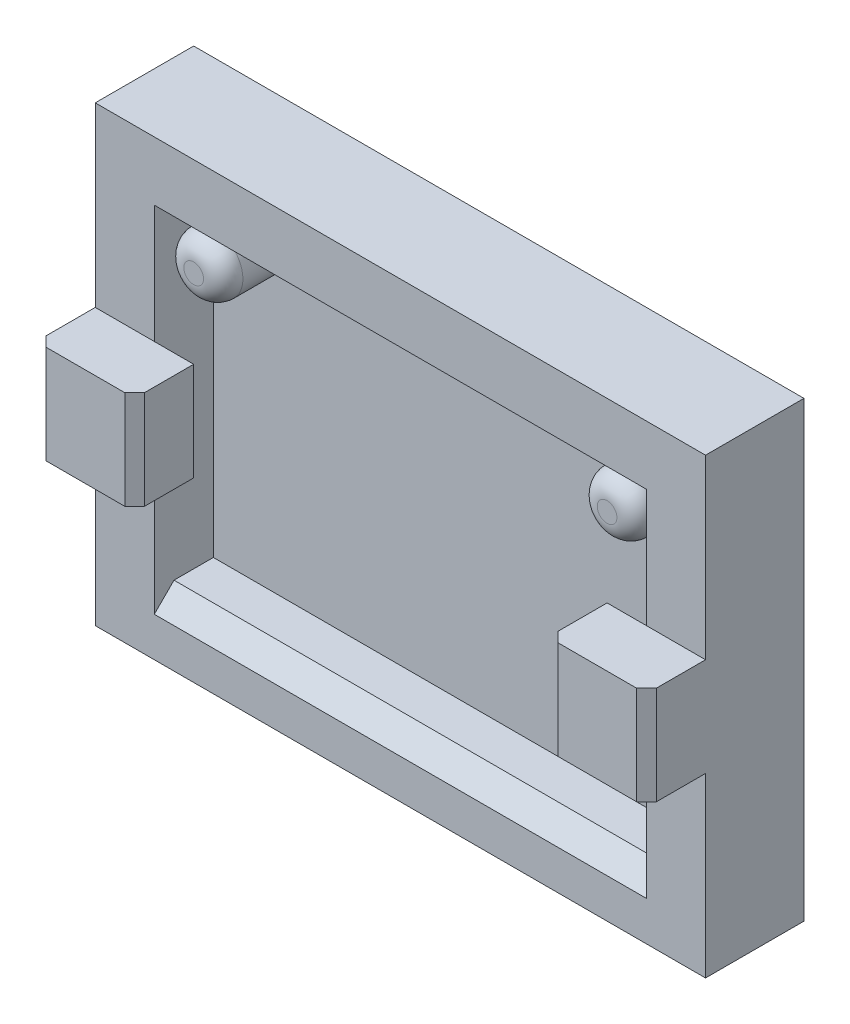
ISO-10303-21;
HEADER;
FILE_DESCRIPTION(('STEP AP214'),'2;1');
FILE_NAME('part.step','',(''),(''),'','','');
FILE_SCHEMA(('AUTOMOTIVE_DESIGN { 1 0 10303 214 1 1 1 1 }'));
ENDSEC;
DATA;
#1=APPLICATION_CONTEXT('core data for automotive mechanical design processes');
#2=APPLICATION_PROTOCOL_DEFINITION('international standard','automotive_design',2000,#1);
#3=PRODUCT_CONTEXT('',#1,'mechanical');
#4=PRODUCT('Part','Part','',(#3));
#5=PRODUCT_RELATED_PRODUCT_CATEGORY('part','',(#4));
#6=PRODUCT_DEFINITION_FORMATION('','',#4);
#7=PRODUCT_DEFINITION_CONTEXT('part definition',#1,'design');
#8=PRODUCT_DEFINITION('design','',#6,#7);
#9=PRODUCT_DEFINITION_SHAPE('','',#8);
#10=(LENGTH_UNIT() NAMED_UNIT(*) SI_UNIT(.MILLI.,.METRE.));
#11=(NAMED_UNIT(*) PLANE_ANGLE_UNIT() SI_UNIT($,.RADIAN.));
#12=(NAMED_UNIT(*) SI_UNIT($,.STERADIAN.) SOLID_ANGLE_UNIT());
#13=UNCERTAINTY_MEASURE_WITH_UNIT(LENGTH_MEASURE(1.E-05),#10,'distance_accuracy_value','');
#14=(GEOMETRIC_REPRESENTATION_CONTEXT(3) GLOBAL_UNCERTAINTY_ASSIGNED_CONTEXT((#13)) GLOBAL_UNIT_ASSIGNED_CONTEXT((#10,
#11,#12)) REPRESENTATION_CONTEXT('',''));
#15=CARTESIAN_POINT('',(0.,0.,0.));
#16=DIRECTION('',(0.,0.,1.));
#17=DIRECTION('',(1.,0.,0.));
#18=AXIS2_PLACEMENT_3D('',#15,#16,#17);
#19=CARTESIAN_POINT('',(0.,0.,5.));
#20=DIRECTION('',(0.,0.,1.));
#21=DIRECTION('',(1.,0.,0.));
#22=AXIS2_PLACEMENT_3D('',#19,#20,#21);
#23=PLANE('',#22);
#24=DIRECTION('',(0.,1.,0.));
#25=VECTOR('',#24,1.);
#26=CARTESIAN_POINT('',(-3.,20.,5.));
#27=LINE('',#26,#25);
#28=CARTESIAN_POINT('',(-3.,2.,5.));
#29=VERTEX_POINT('',#28);
#30=CARTESIAN_POINT('',(-3.,9.,5.));
#31=VERTEX_POINT('',#30);
#32=EDGE_CURVE('E48',#29,#31,#27,.T.);
#33=ORIENTED_EDGE('',*,*,#32,.F.);
#34=DIRECTION('',(-1.,0.,0.));
#35=VECTOR('',#34,1.);
#36=CARTESIAN_POINT('',(-28.,2.,5.));
#37=LINE('',#36,#35);
#38=CARTESIAN_POINT('',(-28.,2.,5.));
#39=VERTEX_POINT('',#38);
#40=EDGE_CURVE('E269',#29,#39,#37,.T.);
#41=ORIENTED_EDGE('',*,*,#40,.T.);
#42=DIRECTION('',(0.,-1.,0.));
#43=VECTOR('',#42,1.);
#44=CARTESIAN_POINT('',(-28.,20.,5.));
#45=LINE('',#44,#43);
#46=CARTESIAN_POINT('',(-28.,9.,5.));
#47=VERTEX_POINT('',#46);
#48=EDGE_CURVE('E55',#47,#39,#45,.T.);
#49=ORIENTED_EDGE('',*,*,#48,.F.);
#50=DIRECTION('',(1.,0.,0.));
#51=VECTOR('',#50,1.);
#52=CARTESIAN_POINT('',(-31.,9.,5.));
#53=LINE('',#52,#51);
#54=CARTESIAN_POINT('',(-31.,9.,5.));
#55=VERTEX_POINT('',#54);
#56=EDGE_CURVE('E239',#55,#47,#53,.T.);
#57=ORIENTED_EDGE('',*,*,#56,.F.);
#58=DIRECTION('',(0.,-1.,0.));
#59=VECTOR('',#58,1.);
#60=CARTESIAN_POINT('',(-31.,23.,5.));
#61=LINE('',#60,#59);
#62=CARTESIAN_POINT('',(-31.,0.,5.));
#63=VERTEX_POINT('',#62);
#64=EDGE_CURVE('E303',#55,#63,#61,.T.);
#65=ORIENTED_EDGE('',*,*,#64,.T.);
#66=DIRECTION('',(1.,0.,0.));
#67=VECTOR('',#66,1.);
#68=CARTESIAN_POINT('',(-31.,0.,5.));
#69=LINE('',#68,#67);
#70=CARTESIAN_POINT('',(0.,0.,5.));
#71=VERTEX_POINT('',#70);
#72=EDGE_CURVE('E356',#63,#71,#69,.T.);
#73=ORIENTED_EDGE('',*,*,#72,.T.);
#74=DIRECTION('',(0.,1.,0.));
#75=VECTOR('',#74,1.);
#76=CARTESIAN_POINT('',(0.,23.,5.));
#77=LINE('',#76,#75);
#78=CARTESIAN_POINT('',(0.,9.,5.));
#79=VERTEX_POINT('',#78);
#80=EDGE_CURVE('E365',#71,#79,#77,.T.);
#81=ORIENTED_EDGE('',*,*,#80,.T.);
#82=DIRECTION('',(1.,0.,0.));
#83=VECTOR('',#82,1.);
#84=CARTESIAN_POINT('',(-5.,9.,5.));
#85=LINE('',#84,#83);
#86=EDGE_CURVE('E210',#31,#79,#85,.T.);
#87=ORIENTED_EDGE('',*,*,#86,.F.);
#88=EDGE_LOOP('',(#33,#41,#49,#57,#65,#73,#81,#87));
#89=FACE_BOUND('',#88,.T.);
#90=ADVANCED_FACE('F33',(#89),#23,.T.);
#91=CARTESIAN_POINT('',(-3.,14.,5.));
#92=VERTEX_POINT('',#91);
#93=CARTESIAN_POINT('',(-3.,20.,5.));
#94=VERTEX_POINT('',#93);
#95=EDGE_CURVE('E695',#92,#94,#27,.T.);
#96=ORIENTED_EDGE('',*,*,#95,.F.);
#97=DIRECTION('',(-1.,0.,0.));
#98=VECTOR('',#97,1.);
#99=CARTESIAN_POINT('',(-5.,14.,5.));
#100=LINE('',#99,#98);
#101=CARTESIAN_POINT('',(0.,14.,5.));
#102=VERTEX_POINT('',#101);
#103=EDGE_CURVE('E221',#102,#92,#100,.T.);
#104=ORIENTED_EDGE('',*,*,#103,.F.);
#105=CARTESIAN_POINT('',(0.,23.,5.));
#106=VERTEX_POINT('',#105);
#107=EDGE_CURVE('E364',#102,#106,#77,.T.);
#108=ORIENTED_EDGE('',*,*,#107,.T.);
#109=DIRECTION('',(-1.,0.,0.));
#110=VECTOR('',#109,1.);
#111=CARTESIAN_POINT('',(-31.,23.,5.));
#112=LINE('',#111,#110);
#113=CARTESIAN_POINT('',(-31.,23.,5.));
#114=VERTEX_POINT('',#113);
#115=EDGE_CURVE('E368',#106,#114,#112,.T.);
#116=ORIENTED_EDGE('',*,*,#115,.T.);
#117=CARTESIAN_POINT('',(-31.,14.,5.));
#118=VERTEX_POINT('',#117);
#119=EDGE_CURVE('E353',#114,#118,#61,.T.);
#120=ORIENTED_EDGE('',*,*,#119,.T.);
#121=DIRECTION('',(-1.,0.,0.));
#122=VECTOR('',#121,1.);
#123=CARTESIAN_POINT('',(-31.,14.,5.));
#124=LINE('',#123,#122);
#125=CARTESIAN_POINT('',(-28.,14.,5.));
#126=VERTEX_POINT('',#125);
#127=EDGE_CURVE('E246',#126,#118,#124,.T.);
#128=ORIENTED_EDGE('',*,*,#127,.F.);
#129=CARTESIAN_POINT('',(-28.,20.,5.));
#130=VERTEX_POINT('',#129);
#131=EDGE_CURVE('E285',#130,#126,#45,.T.);
#132=ORIENTED_EDGE('',*,*,#131,.F.);
#133=DIRECTION('',(-1.,0.,0.));
#134=VECTOR('',#133,1.);
#135=CARTESIAN_POINT('',(-28.,20.,5.));
#136=LINE('',#135,#134);
#137=EDGE_CURVE('E699',#94,#130,#136,.T.);
#138=ORIENTED_EDGE('',*,*,#137,.F.);
#139=EDGE_LOOP('',(#96,#104,#108,#116,#120,#128,#132,#138));
#140=FACE_BOUND('',#139,.T.);
#141=ADVANCED_FACE('F417',(#140),#23,.T.);
#142=CARTESIAN_POINT('',(0.,0.,2.));
#143=DIRECTION('',(0.,0.,1.));
#144=DIRECTION('',(1.,0.,0.));
#145=AXIS2_PLACEMENT_3D('',#142,#143,#144);
#146=PLANE('',#145);
#147=CARTESIAN_POINT('',(-26.,18.,2.));
#148=DIRECTION('',(0.,0.,1.));
#149=DIRECTION('',(1.,0.,0.));
#150=AXIS2_PLACEMENT_3D('',#147,#148,#149);
#151=CIRCLE('',#150,1.5);
#152=CARTESIAN_POINT('',(-24.5,18.,2.));
#153=VERTEX_POINT('',#152);
#154=EDGE_CURVE('E283',#153,#153,#151,.T.);
#155=ORIENTED_EDGE('',*,*,#154,.F.);
#156=EDGE_LOOP('',(#155));
#157=FACE_BOUND('',#156,.T.);
#158=DIRECTION('',(0.,-1.,0.));
#159=VECTOR('',#158,1.);
#160=CARTESIAN_POINT('',(-28.,20.,2.));
#161=LINE('',#160,#159);
#162=CARTESIAN_POINT('',(-28.,20.,2.));
#163=VERTEX_POINT('',#162);
#164=CARTESIAN_POINT('',(-28.,3.,2.));
#165=VERTEX_POINT('',#164);
#166=EDGE_CURVE('E705',#163,#165,#161,.T.);
#167=ORIENTED_EDGE('',*,*,#166,.T.);
#168=DIRECTION('',(1.,0.,0.));
#169=VECTOR('',#168,1.);
#170=CARTESIAN_POINT('',(-28.,3.,2.));
#171=LINE('',#170,#169);
#172=CARTESIAN_POINT('',(-3.,3.,2.));
#173=VERTEX_POINT('',#172);
#174=EDGE_CURVE('E717',#165,#173,#171,.T.);
#175=ORIENTED_EDGE('',*,*,#174,.T.);
#176=DIRECTION('',(0.,1.,0.));
#177=VECTOR('',#176,1.);
#178=CARTESIAN_POINT('',(-3.,20.,2.));
#179=LINE('',#178,#177);
#180=CARTESIAN_POINT('',(-3.,20.,2.));
#181=VERTEX_POINT('',#180);
#182=EDGE_CURVE('E712',#173,#181,#179,.T.);
#183=ORIENTED_EDGE('',*,*,#182,.T.);
#184=DIRECTION('',(-1.,0.,0.));
#185=VECTOR('',#184,1.);
#186=CARTESIAN_POINT('',(-28.,20.,2.));
#187=LINE('',#186,#185);
#188=EDGE_CURVE('E709',#181,#163,#187,.T.);
#189=ORIENTED_EDGE('',*,*,#188,.T.);
#190=EDGE_LOOP('',(#167,#175,#183,#189));
#191=FACE_BOUND('',#190,.T.);
#192=CARTESIAN_POINT('',(-5.,18.,2.));
#193=DIRECTION('',(0.,0.,1.));
#194=DIRECTION('',(1.,0.,0.));
#195=AXIS2_PLACEMENT_3D('',#192,#193,#194);
#196=CIRCLE('',#195,1.5);
#197=CARTESIAN_POINT('',(-3.5,18.,2.));
#198=VERTEX_POINT('',#197);
#199=EDGE_CURVE('E256',#198,#198,#196,.T.);
#200=ORIENTED_EDGE('',*,*,#199,.F.);
#201=EDGE_LOOP('',(#200));
#202=FACE_BOUND('',#201,.T.);
#203=ADVANCED_FACE('F424',(#157,#191,#202),#146,.T.);
#204=CARTESIAN_POINT('',(-31.,23.,5.));
#205=DIRECTION('',(1.,0.,0.));
#206=DIRECTION('',(0.,1.,0.));
#207=AXIS2_PLACEMENT_3D('',#204,#205,#206);
#208=PLANE('',#207);
#209=DIRECTION('',(0.,0.,-1.));
#210=VECTOR('',#209,1.);
#211=CARTESIAN_POINT('',(-31.,9.,8.));
#212=LINE('',#211,#210);
#213=CARTESIAN_POINT('',(-31.,9.,7.49999999999999));
#214=VERTEX_POINT('',#213);
#215=EDGE_CURVE('E253',#214,#55,#212,.T.);
#216=ORIENTED_EDGE('',*,*,#215,.F.);
#217=DIRECTION('',(0.,1.,0.));
#218=VECTOR('',#217,1.);
#219=CARTESIAN_POINT('',(-31.,14.,7.49999999999999));
#220=LINE('',#219,#218);
#221=CARTESIAN_POINT('',(-31.,14.,7.49999999999999));
#222=VERTEX_POINT('',#221);
#223=EDGE_CURVE('E264',#214,#222,#220,.T.);
#224=ORIENTED_EDGE('',*,*,#223,.T.);
#225=DIRECTION('',(0.,0.,-1.));
#226=VECTOR('',#225,1.);
#227=CARTESIAN_POINT('',(-31.,14.,8.));
#228=LINE('',#227,#226);
#229=EDGE_CURVE('E235',#222,#118,#228,.T.);
#230=ORIENTED_EDGE('',*,*,#229,.T.);
#231=ORIENTED_EDGE('',*,*,#119,.F.);
#232=DIRECTION('',(0.,0.,-1.));
#233=VECTOR('',#232,1.);
#234=CARTESIAN_POINT('',(-31.,23.,5.));
#235=LINE('',#234,#233);
#236=CARTESIAN_POINT('',(-31.,23.,0.));
#237=VERTEX_POINT('',#236);
#238=EDGE_CURVE('E370',#114,#237,#235,.T.);
#239=ORIENTED_EDGE('',*,*,#238,.T.);
#240=DIRECTION('',(0.,-1.,0.));
#241=VECTOR('',#240,1.);
#242=CARTESIAN_POINT('',(-31.,23.,0.));
#243=LINE('',#242,#241);
#244=CARTESIAN_POINT('',(-31.,0.,0.));
#245=VERTEX_POINT('',#244);
#246=EDGE_CURVE('E371',#237,#245,#243,.T.);
#247=ORIENTED_EDGE('',*,*,#246,.T.);
#248=DIRECTION('',(0.,0.,-1.));
#249=VECTOR('',#248,1.);
#250=CARTESIAN_POINT('',(-31.,0.,5.));
#251=LINE('',#250,#249);
#252=EDGE_CURVE('E389',#63,#245,#251,.T.);
#253=ORIENTED_EDGE('',*,*,#252,.F.);
#254=ORIENTED_EDGE('',*,*,#64,.F.);
#255=EDGE_LOOP('',(#216,#224,#230,#231,#239,#247,#253,#254));
#256=FACE_BOUND('',#255,.T.);
#257=ADVANCED_FACE('F300',(#256),#208,.F.);
#258=CARTESIAN_POINT('',(-31.,0.,5.));
#259=DIRECTION('',(0.,1.,0.));
#260=DIRECTION('',(0.,0.,1.));
#261=AXIS2_PLACEMENT_3D('',#258,#259,#260);
#262=PLANE('',#261);
#263=DIRECTION('',(1.,0.,0.));
#264=VECTOR('',#263,1.);
#265=CARTESIAN_POINT('',(-31.,0.,0.));
#266=LINE('',#265,#264);
#267=CARTESIAN_POINT('',(0.,0.,0.));
#268=VERTEX_POINT('',#267);
#269=EDGE_CURVE('E374',#245,#268,#266,.T.);
#270=ORIENTED_EDGE('',*,*,#269,.T.);
#271=DIRECTION('',(0.,0.,-1.));
#272=VECTOR('',#271,1.);
#273=CARTESIAN_POINT('',(0.,0.,5.));
#274=LINE('',#273,#272);
#275=EDGE_CURVE('E386',#71,#268,#274,.T.);
#276=ORIENTED_EDGE('',*,*,#275,.F.);
#277=ORIENTED_EDGE('',*,*,#72,.F.);
#278=ORIENTED_EDGE('',*,*,#252,.T.);
#279=EDGE_LOOP('',(#270,#276,#277,#278));
#280=FACE_BOUND('',#279,.T.);
#281=ADVANCED_FACE('F441',(#280),#262,.F.);
#282=CARTESIAN_POINT('',(0.,23.,5.));
#283=DIRECTION('',(-1.,0.,0.));
#284=DIRECTION('',(0.,0.,1.));
#285=AXIS2_PLACEMENT_3D('',#282,#283,#284);
#286=PLANE('',#285);
#287=DIRECTION('',(0.,0.,-1.));
#288=VECTOR('',#287,1.);
#289=CARTESIAN_POINT('',(0.,14.,8.));
#290=LINE('',#289,#288);
#291=CARTESIAN_POINT('',(0.,14.,7.5));
#292=VERTEX_POINT('',#291);
#293=EDGE_CURVE('E225',#292,#102,#290,.T.);
#294=ORIENTED_EDGE('',*,*,#293,.F.);
#295=DIRECTION('',(0.,-1.,0.));
#296=VECTOR('',#295,1.);
#297=CARTESIAN_POINT('',(0.,9.,7.5));
#298=LINE('',#297,#296);
#299=CARTESIAN_POINT('',(0.,9.,7.5));
#300=VERTEX_POINT('',#299);
#301=EDGE_CURVE('E327',#292,#300,#298,.T.);
#302=ORIENTED_EDGE('',*,*,#301,.T.);
#303=DIRECTION('',(0.,0.,-1.));
#304=VECTOR('',#303,1.);
#305=CARTESIAN_POINT('',(0.,9.,8.));
#306=LINE('',#305,#304);
#307=EDGE_CURVE('E200',#300,#79,#306,.T.);
#308=ORIENTED_EDGE('',*,*,#307,.T.);
#309=ORIENTED_EDGE('',*,*,#80,.F.);
#310=ORIENTED_EDGE('',*,*,#275,.T.);
#311=DIRECTION('',(0.,1.,0.));
#312=VECTOR('',#311,1.);
#313=CARTESIAN_POINT('',(0.,23.,0.));
#314=LINE('',#313,#312);
#315=CARTESIAN_POINT('',(0.,23.,0.));
#316=VERTEX_POINT('',#315);
#317=EDGE_CURVE('E377',#268,#316,#314,.T.);
#318=ORIENTED_EDGE('',*,*,#317,.T.);
#319=DIRECTION('',(0.,0.,-1.));
#320=VECTOR('',#319,1.);
#321=CARTESIAN_POINT('',(0.,23.,5.));
#322=LINE('',#321,#320);
#323=EDGE_CURVE('E383',#106,#316,#322,.T.);
#324=ORIENTED_EDGE('',*,*,#323,.F.);
#325=ORIENTED_EDGE('',*,*,#107,.F.);
#326=EDGE_LOOP('',(#294,#302,#308,#309,#310,#318,#324,#325));
#327=FACE_BOUND('',#326,.T.);
#328=ADVANCED_FACE('F437',(#327),#286,.F.);
#329=CARTESIAN_POINT('',(-31.,23.,5.));
#330=DIRECTION('',(0.,-1.,0.));
#331=DIRECTION('',(1.,0.,0.));
#332=AXIS2_PLACEMENT_3D('',#329,#330,#331);
#333=PLANE('',#332);
#334=DIRECTION('',(-1.,0.,0.));
#335=VECTOR('',#334,1.);
#336=CARTESIAN_POINT('',(-31.,23.,0.));
#337=LINE('',#336,#335);
#338=EDGE_CURVE('E379',#316,#237,#337,.T.);
#339=ORIENTED_EDGE('',*,*,#338,.T.);
#340=ORIENTED_EDGE('',*,*,#238,.F.);
#341=ORIENTED_EDGE('',*,*,#115,.F.);
#342=ORIENTED_EDGE('',*,*,#323,.T.);
#343=EDGE_LOOP('',(#339,#340,#341,#342));
#344=FACE_BOUND('',#343,.T.);
#345=ADVANCED_FACE('F433',(#344),#333,.F.);
#346=CARTESIAN_POINT('',(0.,0.,0.));
#347=DIRECTION('',(0.,0.,1.));
#348=DIRECTION('',(1.,0.,0.));
#349=AXIS2_PLACEMENT_3D('',#346,#347,#348);
#350=PLANE('',#349);
#351=ORIENTED_EDGE('',*,*,#246,.F.);
#352=ORIENTED_EDGE('',*,*,#338,.F.);
#353=ORIENTED_EDGE('',*,*,#317,.F.);
#354=ORIENTED_EDGE('',*,*,#269,.F.);
#355=EDGE_LOOP('',(#351,#352,#353,#354));
#356=FACE_BOUND('',#355,.T.);
#357=ADVANCED_FACE('F430',(#356),#350,.F.);
#358=CARTESIAN_POINT('',(-28.,20.,2.));
#359=DIRECTION('',(-1.,0.,0.));
#360=DIRECTION('',(0.,-1.,0.));
#361=AXIS2_PLACEMENT_3D('',#358,#359,#360);
#362=PLANE('',#361);
#363=ORIENTED_EDGE('',*,*,#131,.T.);
#364=EDGE_CURVE('E282',#126,#47,#45,.T.);
#365=ORIENTED_EDGE('',*,*,#364,.T.);
#366=ORIENTED_EDGE('',*,*,#48,.T.);
#367=DIRECTION('',(0.,0.70710678118655,-0.707106781186545));
#368=VECTOR('',#367,1.);
#369=CARTESIAN_POINT('',(-28.,12.5000000000001,-5.49999999999999));
#370=LINE('',#369,#368);
#371=CARTESIAN_POINT('',(-28.,3.,4.00000000000001));
#372=VERTEX_POINT('',#371);
#373=EDGE_CURVE('E11',#39,#372,#370,.T.);
#374=ORIENTED_EDGE('',*,*,#373,.T.);
#375=DIRECTION('',(0.,0.,1.));
#376=VECTOR('',#375,1.);
#377=CARTESIAN_POINT('',(-28.,3.,2.));
#378=LINE('',#377,#376);
#379=EDGE_CURVE('E360',#165,#372,#378,.T.);
#380=ORIENTED_EDGE('',*,*,#379,.F.);
#381=ORIENTED_EDGE('',*,*,#166,.F.);
#382=DIRECTION('',(0.,0.,1.));
#383=VECTOR('',#382,1.);
#384=CARTESIAN_POINT('',(-28.,20.,2.));
#385=LINE('',#384,#383);
#386=EDGE_CURVE('E375',#163,#130,#385,.T.);
#387=ORIENTED_EDGE('',*,*,#386,.T.);
#388=EDGE_LOOP('',(#363,#365,#366,#374,#380,#381,#387));
#389=FACE_BOUND('',#388,.T.);
#390=ADVANCED_FACE('F428',(#389),#362,.F.);
#391=CARTESIAN_POINT('',(-28.,20.,2.));
#392=DIRECTION('',(0.,1.,0.));
#393=DIRECTION('',(-1.,0.,0.));
#394=AXIS2_PLACEMENT_3D('',#391,#392,#393);
#395=PLANE('',#394);
#396=ORIENTED_EDGE('',*,*,#137,.T.);
#397=ORIENTED_EDGE('',*,*,#386,.F.);
#398=ORIENTED_EDGE('',*,*,#188,.F.);
#399=DIRECTION('',(0.,0.,1.));
#400=VECTOR('',#399,1.);
#401=CARTESIAN_POINT('',(-3.,20.,2.));
#402=LINE('',#401,#400);
#403=EDGE_CURVE('E707',#181,#94,#402,.T.);
#404=ORIENTED_EDGE('',*,*,#403,.T.);
#405=EDGE_LOOP('',(#396,#397,#398,#404));
#406=FACE_BOUND('',#405,.T.);
#407=ADVANCED_FACE('F485',(#406),#395,.F.);
#408=CARTESIAN_POINT('',(-3.,20.,2.));
#409=DIRECTION('',(1.,0.,0.));
#410=DIRECTION('',(0.,1.,0.));
#411=AXIS2_PLACEMENT_3D('',#408,#409,#410);
#412=PLANE('',#411);
#413=ORIENTED_EDGE('',*,*,#32,.T.);
#414=EDGE_CURVE('E208',#31,#92,#27,.T.);
#415=ORIENTED_EDGE('',*,*,#414,.T.);
#416=ORIENTED_EDGE('',*,*,#95,.T.);
#417=ORIENTED_EDGE('',*,*,#403,.F.);
#418=ORIENTED_EDGE('',*,*,#182,.F.);
#419=DIRECTION('',(0.,0.,1.));
#420=VECTOR('',#419,1.);
#421=CARTESIAN_POINT('',(-3.,3.,2.));
#422=LINE('',#421,#420);
#423=CARTESIAN_POINT('',(-3.,3.,4.00000000000001));
#424=VERTEX_POINT('',#423);
#425=EDGE_CURVE('E275',#173,#424,#422,.T.);
#426=ORIENTED_EDGE('',*,*,#425,.T.);
#427=DIRECTION('',(0.,-0.70710678118655,0.707106781186545));
#428=VECTOR('',#427,1.);
#429=CARTESIAN_POINT('',(-3.,12.5000000000001,-5.49999999999999));
#430=LINE('',#429,#428);
#431=EDGE_CURVE('E41',#424,#29,#430,.T.);
#432=ORIENTED_EDGE('',*,*,#431,.T.);
#433=EDGE_LOOP('',(#413,#415,#416,#417,#418,#426,#432));
#434=FACE_BOUND('',#433,.T.);
#435=ADVANCED_FACE('F273',(#434),#412,.F.);
#436=CARTESIAN_POINT('',(-28.,3.,2.));
#437=DIRECTION('',(0.,-1.,0.));
#438=DIRECTION('',(0.,0.,-1.));
#439=AXIS2_PLACEMENT_3D('',#436,#437,#438);
#440=PLANE('',#439);
#441=ORIENTED_EDGE('',*,*,#379,.T.);
#442=DIRECTION('',(1.,0.,0.));
#443=VECTOR('',#442,1.);
#444=CARTESIAN_POINT('',(-3.,3.,4.00000000000001));
#445=LINE('',#444,#443);
#446=EDGE_CURVE('E266',#372,#424,#445,.T.);
#447=ORIENTED_EDGE('',*,*,#446,.T.);
#448=ORIENTED_EDGE('',*,*,#425,.F.);
#449=ORIENTED_EDGE('',*,*,#174,.F.);
#450=EDGE_LOOP('',(#441,#447,#448,#449));
#451=FACE_BOUND('',#450,.T.);
#452=ADVANCED_FACE('F474',(#451),#440,.F.);
#453=CARTESIAN_POINT('',(-26.,18.,5.));
#454=DIRECTION('',(0.,0.,-1.));
#455=DIRECTION('',(-1.,0.,0.));
#456=AXIS2_PLACEMENT_3D('',#453,#454,#455);
#457=CYLINDRICAL_SURFACE('',#456,1.5);
#458=CARTESIAN_POINT('',(-26.,18.,4.));
#459=DIRECTION('',(0.,0.,1.));
#460=DIRECTION('',(1.,0.,0.));
#461=AXIS2_PLACEMENT_3D('',#458,#459,#460);
#462=CIRCLE('',#461,1.5);
#463=CARTESIAN_POINT('',(-24.5,18.,4.));
#464=VERTEX_POINT('',#463);
#465=EDGE_CURVE('E342',#464,#464,#462,.F.);
#466=ORIENTED_EDGE('',*,*,#465,.T.);
#467=EDGE_LOOP('',(#466));
#468=FACE_BOUND('',#467,.T.);
#469=ORIENTED_EDGE('',*,*,#154,.T.);
#470=EDGE_LOOP('',(#469));
#471=FACE_BOUND('',#470,.T.);
#472=ADVANCED_FACE('F478',(#468,#471),#457,.T.);
#473=CARTESIAN_POINT('',(-26.,18.,5.));
#474=DIRECTION('',(0.,0.,1.));
#475=DIRECTION('',(1.,0.,0.));
#476=AXIS2_PLACEMENT_3D('',#473,#474,#475);
#477=PLANE('',#476);
#478=CARTESIAN_POINT('',(-26.,18.,5.));
#479=DIRECTION('',(0.,0.,1.));
#480=DIRECTION('',(1.,0.,0.));
#481=AXIS2_PLACEMENT_3D('',#478,#479,#480);
#482=CIRCLE('',#481,0.500000000000001);
#483=CARTESIAN_POINT('',(-25.5,18.,5.));
#484=VERTEX_POINT('',#483);
#485=EDGE_CURVE('E344',#484,#484,#482,.T.);
#486=ORIENTED_EDGE('',*,*,#485,.T.);
#487=EDGE_LOOP('',(#486));
#488=FACE_BOUND('',#487,.T.);
#489=ADVANCED_FACE('F413',(#488),#477,.T.);
#490=CARTESIAN_POINT('',(-5.,18.,5.));
#491=DIRECTION('',(0.,0.,-1.));
#492=DIRECTION('',(-1.,0.,0.));
#493=AXIS2_PLACEMENT_3D('',#490,#491,#492);
#494=CYLINDRICAL_SURFACE('',#493,1.5);
#495=CARTESIAN_POINT('',(-5.,18.,4.));
#496=DIRECTION('',(0.,0.,1.));
#497=DIRECTION('',(1.,0.,0.));
#498=AXIS2_PLACEMENT_3D('',#495,#496,#497);
#499=CIRCLE('',#498,1.5);
#500=CARTESIAN_POINT('',(-3.5,18.,4.));
#501=VERTEX_POINT('',#500);
#502=EDGE_CURVE('E349',#501,#501,#499,.F.);
#503=ORIENTED_EDGE('',*,*,#502,.T.);
#504=EDGE_LOOP('',(#503));
#505=FACE_BOUND('',#504,.T.);
#506=ORIENTED_EDGE('',*,*,#199,.T.);
#507=EDGE_LOOP('',(#506));
#508=FACE_BOUND('',#507,.T.);
#509=ADVANCED_FACE('F397',(#505,#508),#494,.T.);
#510=CARTESIAN_POINT('',(-5.,18.,5.));
#511=DIRECTION('',(0.,0.,1.));
#512=DIRECTION('',(1.,0.,0.));
#513=AXIS2_PLACEMENT_3D('',#510,#511,#512);
#514=PLANE('',#513);
#515=CARTESIAN_POINT('',(-5.,18.,5.));
#516=DIRECTION('',(0.,0.,1.));
#517=DIRECTION('',(1.,0.,0.));
#518=AXIS2_PLACEMENT_3D('',#515,#516,#517);
#519=CIRCLE('',#518,0.500000000000002);
#520=CARTESIAN_POINT('',(-4.5,18.,5.));
#521=VERTEX_POINT('',#520);
#522=EDGE_CURVE('E392',#521,#521,#519,.T.);
#523=ORIENTED_EDGE('',*,*,#522,.T.);
#524=EDGE_LOOP('',(#523));
#525=FACE_BOUND('',#524,.T.);
#526=ADVANCED_FACE('F404',(#525),#514,.T.);
#527=CARTESIAN_POINT('',(-5.,18.,4.));
#528=DIRECTION('',(0.,0.,1.));
#529=DIRECTION('',(1.,0.,0.));
#530=AXIS2_PLACEMENT_3D('',#527,#528,#529);
#531=DEGENERATE_TOROIDAL_SURFACE('',#530,0.500000000000002,1.,.T.);
#532=ORIENTED_EDGE('',*,*,#502,.F.);
#533=EDGE_LOOP('',(#532));
#534=FACE_BOUND('',#533,.T.);
#535=ORIENTED_EDGE('',*,*,#522,.F.);
#536=EDGE_LOOP('',(#535));
#537=FACE_BOUND('',#536,.T.);
#538=ADVANCED_FACE('F400',(#534,#537),#531,.T.);
#539=CARTESIAN_POINT('',(-26.,18.,4.));
#540=DIRECTION('',(0.,0.,1.));
#541=DIRECTION('',(1.,0.,0.));
#542=AXIS2_PLACEMENT_3D('',#539,#540,#541);
#543=DEGENERATE_TOROIDAL_SURFACE('',#542,0.500000000000001,1.,.T.);
#544=ORIENTED_EDGE('',*,*,#465,.F.);
#545=EDGE_LOOP('',(#544));
#546=FACE_BOUND('',#545,.T.);
#547=ORIENTED_EDGE('',*,*,#485,.F.);
#548=EDGE_LOOP('',(#547));
#549=FACE_BOUND('',#548,.T.);
#550=ADVANCED_FACE('F403',(#546,#549),#543,.T.);
#551=CARTESIAN_POINT('',(-31.,9.,8.));
#552=DIRECTION('',(0.,1.,0.));
#553=DIRECTION('',(0.,0.,1.));
#554=AXIS2_PLACEMENT_3D('',#551,#552,#553);
#555=PLANE('',#554);
#556=DIRECTION('',(0.,0.,-1.));
#557=VECTOR('',#556,1.);
#558=CARTESIAN_POINT('',(-26.,9.,8.));
#559=LINE('',#558,#557);
#560=CARTESIAN_POINT('',(-26.,9.,7.49999999999999));
#561=VERTEX_POINT('',#560);
#562=CARTESIAN_POINT('',(-26.,9.,5.));
#563=VERTEX_POINT('',#562);
#564=EDGE_CURVE('E257',#561,#563,#559,.T.);
#565=ORIENTED_EDGE('',*,*,#564,.F.);
#566=DIRECTION('',(-0.707106781186541,0.,0.707106781186554));
#567=VECTOR('',#566,1.);
#568=CARTESIAN_POINT('',(-26.5,9.,8.));
#569=LINE('',#568,#567);
#570=CARTESIAN_POINT('',(-26.5,9.,8.));
#571=VERTEX_POINT('',#570);
#572=EDGE_CURVE('E262',#561,#571,#569,.T.);
#573=ORIENTED_EDGE('',*,*,#572,.T.);
#574=DIRECTION('',(1.,0.,0.));
#575=VECTOR('',#574,1.);
#576=CARTESIAN_POINT('',(-31.,9.,8.));
#577=LINE('',#576,#575);
#578=CARTESIAN_POINT('',(-30.5,9.,8.));
#579=VERTEX_POINT('',#578);
#580=EDGE_CURVE('E228',#579,#571,#577,.T.);
#581=ORIENTED_EDGE('',*,*,#580,.F.);
#582=DIRECTION('',(-0.707106781186543,0.,-0.707106781186552));
#583=VECTOR('',#582,1.);
#584=CARTESIAN_POINT('',(-30.5,9.,8.));
#585=LINE('',#584,#583);
#586=EDGE_CURVE('E260',#579,#214,#585,.T.);
#587=ORIENTED_EDGE('',*,*,#586,.T.);
#588=ORIENTED_EDGE('',*,*,#215,.T.);
#589=ORIENTED_EDGE('',*,*,#56,.T.);
#590=EDGE_CURVE('E199',#47,#563,#53,.T.);
#591=ORIENTED_EDGE('',*,*,#590,.T.);
#592=EDGE_LOOP('',(#565,#573,#581,#587,#588,#589,#591));
#593=FACE_BOUND('',#592,.T.);
#594=ADVANCED_FACE('F295',(#593),#555,.F.);
#595=CARTESIAN_POINT('',(-26.,14.,8.));
#596=DIRECTION('',(-1.,0.,0.));
#597=DIRECTION('',(0.,-1.,0.));
#598=AXIS2_PLACEMENT_3D('',#595,#596,#597);
#599=PLANE('',#598);
#600=DIRECTION('',(0.,0.,-1.));
#601=VECTOR('',#600,1.);
#602=CARTESIAN_POINT('',(-26.,14.,8.));
#603=LINE('',#602,#601);
#604=CARTESIAN_POINT('',(-26.,14.,7.49999999999999));
#605=VERTEX_POINT('',#604);
#606=CARTESIAN_POINT('',(-26.,14.,5.));
#607=VERTEX_POINT('',#606);
#608=EDGE_CURVE('E319',#605,#607,#603,.T.);
#609=ORIENTED_EDGE('',*,*,#608,.F.);
#610=DIRECTION('',(0.,-1.,0.));
#611=VECTOR('',#610,1.);
#612=CARTESIAN_POINT('',(-26.,9.,7.49999999999999));
#613=LINE('',#612,#611);
#614=EDGE_CURVE('E258',#605,#561,#613,.T.);
#615=ORIENTED_EDGE('',*,*,#614,.T.);
#616=ORIENTED_EDGE('',*,*,#564,.T.);
#617=DIRECTION('',(0.,1.,0.));
#618=VECTOR('',#617,1.);
#619=CARTESIAN_POINT('',(-26.,14.,5.));
#620=LINE('',#619,#618);
#621=EDGE_CURVE('E240',#563,#607,#620,.T.);
#622=ORIENTED_EDGE('',*,*,#621,.T.);
#623=EDGE_LOOP('',(#609,#615,#616,#622));
#624=FACE_BOUND('',#623,.T.);
#625=ADVANCED_FACE('F602',(#624),#599,.F.);
#626=CARTESIAN_POINT('',(-31.,14.,8.));
#627=DIRECTION('',(0.,-1.,0.));
#628=DIRECTION('',(0.,0.,-1.));
#629=AXIS2_PLACEMENT_3D('',#626,#627,#628);
#630=PLANE('',#629);
#631=DIRECTION('',(-1.,0.,0.));
#632=VECTOR('',#631,1.);
#633=CARTESIAN_POINT('',(-31.,14.,8.));
#634=LINE('',#633,#632);
#635=CARTESIAN_POINT('',(-26.5,14.,8.));
#636=VERTEX_POINT('',#635);
#637=CARTESIAN_POINT('',(-30.5,14.,8.));
#638=VERTEX_POINT('',#637);
#639=EDGE_CURVE('E231',#636,#638,#634,.T.);
#640=ORIENTED_EDGE('',*,*,#639,.F.);
#641=DIRECTION('',(0.707106781186541,0.,-0.707106781186554));
#642=VECTOR('',#641,1.);
#643=CARTESIAN_POINT('',(-26.5,14.,8.00000000000001));
#644=LINE('',#643,#642);
#645=EDGE_CURVE('E313',#636,#605,#644,.T.);
#646=ORIENTED_EDGE('',*,*,#645,.T.);
#647=ORIENTED_EDGE('',*,*,#608,.T.);
#648=EDGE_CURVE('E232',#607,#126,#124,.T.);
#649=ORIENTED_EDGE('',*,*,#648,.T.);
#650=ORIENTED_EDGE('',*,*,#127,.T.);
#651=ORIENTED_EDGE('',*,*,#229,.F.);
#652=DIRECTION('',(0.707106781186543,0.,0.707106781186552));
#653=VECTOR('',#652,1.);
#654=CARTESIAN_POINT('',(-30.5,14.,8.));
#655=LINE('',#654,#653);
#656=EDGE_CURVE('E309',#222,#638,#655,.T.);
#657=ORIENTED_EDGE('',*,*,#656,.T.);
#658=EDGE_LOOP('',(#640,#646,#647,#649,#650,#651,#657));
#659=FACE_BOUND('',#658,.T.);
#660=ADVANCED_FACE('F610',(#659),#630,.F.);
#661=CARTESIAN_POINT('',(0.,0.,8.));
#662=DIRECTION('',(0.,0.,1.));
#663=DIRECTION('',(1.,0.,0.));
#664=AXIS2_PLACEMENT_3D('',#661,#662,#663);
#665=PLANE('',#664);
#666=ORIENTED_EDGE('',*,*,#580,.T.);
#667=DIRECTION('',(0.,1.,0.));
#668=VECTOR('',#667,1.);
#669=CARTESIAN_POINT('',(-26.5,14.,8.));
#670=LINE('',#669,#668);
#671=EDGE_CURVE('E314',#571,#636,#670,.T.);
#672=ORIENTED_EDGE('',*,*,#671,.T.);
#673=ORIENTED_EDGE('',*,*,#639,.T.);
#674=DIRECTION('',(0.,-1.,0.));
#675=VECTOR('',#674,1.);
#676=CARTESIAN_POINT('',(-30.5,9.,8.));
#677=LINE('',#676,#675);
#678=EDGE_CURVE('E310',#638,#579,#677,.T.);
#679=ORIENTED_EDGE('',*,*,#678,.T.);
#680=EDGE_LOOP('',(#666,#672,#673,#679));
#681=FACE_BOUND('',#680,.T.);
#682=ADVANCED_FACE('F566',(#681),#665,.T.);
#683=CARTESIAN_POINT('',(0.,0.,5.));
#684=DIRECTION('',(0.,0.,1.));
#685=DIRECTION('',(1.,0.,0.));
#686=AXIS2_PLACEMENT_3D('',#683,#684,#685);
#687=PLANE('',#686);
#688=ORIENTED_EDGE('',*,*,#364,.F.);
#689=ORIENTED_EDGE('',*,*,#648,.F.);
#690=ORIENTED_EDGE('',*,*,#621,.F.);
#691=ORIENTED_EDGE('',*,*,#590,.F.);
#692=EDGE_LOOP('',(#688,#689,#690,#691));
#693=FACE_BOUND('',#692,.T.);
#694=ADVANCED_FACE('F289',(#693),#687,.F.);
#695=CARTESIAN_POINT('',(0.,0.,5.));
#696=DIRECTION('',(0.,0.,1.));
#697=DIRECTION('',(1.,0.,0.));
#698=AXIS2_PLACEMENT_3D('',#695,#696,#697);
#699=PLANE('',#698);
#700=CARTESIAN_POINT('',(-5.,14.,5.));
#701=VERTEX_POINT('',#700);
#702=EDGE_CURVE('E209',#92,#701,#100,.T.);
#703=ORIENTED_EDGE('',*,*,#702,.F.);
#704=ORIENTED_EDGE('',*,*,#414,.F.);
#705=CARTESIAN_POINT('',(-5.,9.,5.));
#706=VERTEX_POINT('',#705);
#707=EDGE_CURVE('E193',#706,#31,#85,.T.);
#708=ORIENTED_EDGE('',*,*,#707,.F.);
#709=DIRECTION('',(0.,-1.,0.));
#710=VECTOR('',#709,1.);
#711=CARTESIAN_POINT('',(-5.,14.,5.));
#712=LINE('',#711,#710);
#713=EDGE_CURVE('E206',#701,#706,#712,.T.);
#714=ORIENTED_EDGE('',*,*,#713,.F.);
#715=EDGE_LOOP('',(#703,#704,#708,#714));
#716=FACE_BOUND('',#715,.T.);
#717=ADVANCED_FACE('F205',(#716),#699,.F.);
#718=CARTESIAN_POINT('',(-5.,14.,8.));
#719=DIRECTION('',(1.,0.,0.));
#720=DIRECTION('',(0.,1.,0.));
#721=AXIS2_PLACEMENT_3D('',#718,#719,#720);
#722=PLANE('',#721);
#723=DIRECTION('',(0.,0.,-1.));
#724=VECTOR('',#723,1.);
#725=CARTESIAN_POINT('',(-5.,9.,8.));
#726=LINE('',#725,#724);
#727=CARTESIAN_POINT('',(-5.,9.,7.5));
#728=VERTEX_POINT('',#727);
#729=EDGE_CURVE('E188',#728,#706,#726,.T.);
#730=ORIENTED_EDGE('',*,*,#729,.F.);
#731=DIRECTION('',(0.,1.,0.));
#732=VECTOR('',#731,1.);
#733=CARTESIAN_POINT('',(-5.,14.,7.5));
#734=LINE('',#733,#732);
#735=CARTESIAN_POINT('',(-5.,14.,7.5));
#736=VERTEX_POINT('',#735);
#737=EDGE_CURVE('E322',#728,#736,#734,.T.);
#738=ORIENTED_EDGE('',*,*,#737,.T.);
#739=DIRECTION('',(0.,0.,-1.));
#740=VECTOR('',#739,1.);
#741=CARTESIAN_POINT('',(-5.,14.,8.));
#742=LINE('',#741,#740);
#743=EDGE_CURVE('E214',#736,#701,#742,.T.);
#744=ORIENTED_EDGE('',*,*,#743,.T.);
#745=ORIENTED_EDGE('',*,*,#713,.T.);
#746=EDGE_LOOP('',(#730,#738,#744,#745));
#747=FACE_BOUND('',#746,.T.);
#748=ADVANCED_FACE('F212',(#747),#722,.F.);
#749=CARTESIAN_POINT('',(-5.,9.,8.));
#750=DIRECTION('',(0.,1.,0.));
#751=DIRECTION('',(0.,0.,1.));
#752=AXIS2_PLACEMENT_3D('',#749,#750,#751);
#753=PLANE('',#752);
#754=ORIENTED_EDGE('',*,*,#307,.F.);
#755=DIRECTION('',(-0.707106781186545,0.,0.70710678118655));
#756=VECTOR('',#755,1.);
#757=CARTESIAN_POINT('',(-0.5,9.,8.));
#758=LINE('',#757,#756);
#759=CARTESIAN_POINT('',(-0.500000000000002,9.,8.));
#760=VERTEX_POINT('',#759);
#761=EDGE_CURVE('E324',#300,#760,#758,.T.);
#762=ORIENTED_EDGE('',*,*,#761,.T.);
#763=DIRECTION('',(1.,0.,0.));
#764=VECTOR('',#763,1.);
#765=CARTESIAN_POINT('',(-5.,9.,8.));
#766=LINE('',#765,#764);
#767=CARTESIAN_POINT('',(-4.5,9.,8.));
#768=VERTEX_POINT('',#767);
#769=EDGE_CURVE('E223',#768,#760,#766,.T.);
#770=ORIENTED_EDGE('',*,*,#769,.F.);
#771=DIRECTION('',(-0.707106781186545,0.,-0.70710678118655));
#772=VECTOR('',#771,1.);
#773=CARTESIAN_POINT('',(-4.5,9.,8.));
#774=LINE('',#773,#772);
#775=EDGE_CURVE('E195',#768,#728,#774,.T.);
#776=ORIENTED_EDGE('',*,*,#775,.T.);
#777=ORIENTED_EDGE('',*,*,#729,.T.);
#778=ORIENTED_EDGE('',*,*,#707,.T.);
#779=ORIENTED_EDGE('',*,*,#86,.T.);
#780=EDGE_LOOP('',(#754,#762,#770,#776,#777,#778,#779));
#781=FACE_BOUND('',#780,.T.);
#782=ADVANCED_FACE('F191',(#781),#753,.F.);
#783=CARTESIAN_POINT('',(-5.,14.,8.));
#784=DIRECTION('',(0.,-1.,0.));
#785=DIRECTION('',(0.,0.,-1.));
#786=AXIS2_PLACEMENT_3D('',#783,#784,#785);
#787=PLANE('',#786);
#788=DIRECTION('',(-1.,0.,0.));
#789=VECTOR('',#788,1.);
#790=CARTESIAN_POINT('',(-5.,14.,8.));
#791=LINE('',#790,#789);
#792=CARTESIAN_POINT('',(-0.500000000000002,14.,8.));
#793=VERTEX_POINT('',#792);
#794=CARTESIAN_POINT('',(-4.5,14.,8.));
#795=VERTEX_POINT('',#794);
#796=EDGE_CURVE('E218',#793,#795,#791,.T.);
#797=ORIENTED_EDGE('',*,*,#796,.F.);
#798=DIRECTION('',(0.707106781186545,0.,-0.70710678118655));
#799=VECTOR('',#798,1.);
#800=CARTESIAN_POINT('',(-0.5,14.,8.));
#801=LINE('',#800,#799);
#802=EDGE_CURVE('E329',#793,#292,#801,.T.);
#803=ORIENTED_EDGE('',*,*,#802,.T.);
#804=ORIENTED_EDGE('',*,*,#293,.T.);
#805=ORIENTED_EDGE('',*,*,#103,.T.);
#806=ORIENTED_EDGE('',*,*,#702,.T.);
#807=ORIENTED_EDGE('',*,*,#743,.F.);
#808=DIRECTION('',(0.707106781186545,0.,0.70710678118655));
#809=VECTOR('',#808,1.);
#810=CARTESIAN_POINT('',(-4.5,14.,8.));
#811=LINE('',#810,#809);
#812=EDGE_CURVE('E331',#736,#795,#811,.T.);
#813=ORIENTED_EDGE('',*,*,#812,.T.);
#814=EDGE_LOOP('',(#797,#803,#804,#805,#806,#807,#813));
#815=FACE_BOUND('',#814,.T.);
#816=ADVANCED_FACE('F641',(#815),#787,.F.);
#817=CARTESIAN_POINT('',(0.,0.,8.));
#818=DIRECTION('',(0.,0.,1.));
#819=DIRECTION('',(1.,0.,0.));
#820=AXIS2_PLACEMENT_3D('',#817,#818,#819);
#821=PLANE('',#820);
#822=ORIENTED_EDGE('',*,*,#769,.T.);
#823=DIRECTION('',(0.,1.,0.));
#824=VECTOR('',#823,1.);
#825=CARTESIAN_POINT('',(-0.5,14.,8.));
#826=LINE('',#825,#824);
#827=EDGE_CURVE('E333',#760,#793,#826,.T.);
#828=ORIENTED_EDGE('',*,*,#827,.T.);
#829=ORIENTED_EDGE('',*,*,#796,.T.);
#830=DIRECTION('',(0.,-1.,0.));
#831=VECTOR('',#830,1.);
#832=CARTESIAN_POINT('',(-4.5,9.,8.));
#833=LINE('',#832,#831);
#834=EDGE_CURVE('E335',#795,#768,#833,.T.);
#835=ORIENTED_EDGE('',*,*,#834,.T.);
#836=EDGE_LOOP('',(#822,#828,#829,#835));
#837=FACE_BOUND('',#836,.T.);
#838=ADVANCED_FACE('F455',(#837),#821,.T.);
#839=CARTESIAN_POINT('',(-0.5,0.,8.));
#840=DIRECTION('',(0.70710678118655,0.,0.707106781186545));
#841=DIRECTION('',(0.,-1.,0.));
#842=AXIS2_PLACEMENT_3D('',#839,#840,#841);
#843=PLANE('',#842);
#844=ORIENTED_EDGE('',*,*,#761,.F.);
#845=ORIENTED_EDGE('',*,*,#301,.F.);
#846=ORIENTED_EDGE('',*,*,#802,.F.);
#847=ORIENTED_EDGE('',*,*,#827,.F.);
#848=EDGE_LOOP('',(#844,#845,#846,#847));
#849=FACE_BOUND('',#848,.T.);
#850=ADVANCED_FACE('F451',(#849),#843,.T.);
#851=CARTESIAN_POINT('',(-4.49999999999999,0.,8.));
#852=DIRECTION('',(-0.70710678118655,0.,0.707106781186545));
#853=DIRECTION('',(0.,1.,0.));
#854=AXIS2_PLACEMENT_3D('',#851,#852,#853);
#855=PLANE('',#854);
#856=ORIENTED_EDGE('',*,*,#812,.F.);
#857=ORIENTED_EDGE('',*,*,#737,.F.);
#858=ORIENTED_EDGE('',*,*,#775,.F.);
#859=ORIENTED_EDGE('',*,*,#834,.F.);
#860=EDGE_LOOP('',(#856,#857,#858,#859));
#861=FACE_BOUND('',#860,.T.);
#862=ADVANCED_FACE('F454',(#861),#855,.T.);
#863=CARTESIAN_POINT('',(-26.5,0.,8.));
#864=DIRECTION('',(0.707106781186554,0.,0.707106781186541));
#865=DIRECTION('',(0.,-1.,0.));
#866=AXIS2_PLACEMENT_3D('',#863,#864,#865);
#867=PLANE('',#866);
#868=ORIENTED_EDGE('',*,*,#572,.F.);
#869=ORIENTED_EDGE('',*,*,#614,.F.);
#870=ORIENTED_EDGE('',*,*,#645,.F.);
#871=ORIENTED_EDGE('',*,*,#671,.F.);
#872=EDGE_LOOP('',(#868,#869,#870,#871));
#873=FACE_BOUND('',#872,.T.);
#874=ADVANCED_FACE('F459',(#873),#867,.T.);
#875=CARTESIAN_POINT('',(-30.5,0.,8.));
#876=DIRECTION('',(-0.707106781186552,0.,0.707106781186542));
#877=DIRECTION('',(0.,1.,0.));
#878=AXIS2_PLACEMENT_3D('',#875,#876,#877);
#879=PLANE('',#878);
#880=ORIENTED_EDGE('',*,*,#656,.F.);
#881=ORIENTED_EDGE('',*,*,#223,.F.);
#882=ORIENTED_EDGE('',*,*,#586,.F.);
#883=ORIENTED_EDGE('',*,*,#678,.F.);
#884=EDGE_LOOP('',(#880,#881,#882,#883));
#885=FACE_BOUND('',#884,.T.);
#886=ADVANCED_FACE('F306',(#885),#879,.T.);
#887=CARTESIAN_POINT('',(-28.,3.,4.00000000000001));
#888=DIRECTION('',(0.,0.707106781186545,0.70710678118655));
#889=DIRECTION('',(-1.,0.,0.));
#890=AXIS2_PLACEMENT_3D('',#887,#888,#889);
#891=PLANE('',#890);
#892=ORIENTED_EDGE('',*,*,#373,.F.);
#893=ORIENTED_EDGE('',*,*,#40,.F.);
#894=ORIENTED_EDGE('',*,*,#431,.F.);
#895=ORIENTED_EDGE('',*,*,#446,.F.);
#896=EDGE_LOOP('',(#892,#893,#894,#895));
#897=FACE_BOUND('',#896,.T.);
#898=ADVANCED_FACE('F35',(#897),#891,.T.);
#899=CLOSED_SHELL('',(#90,#141,#203,#257,#281,#328,#345,#357,#390,#407,#435,#452,#472,#489,#509,
#526,#538,#550,#594,#625,#660,#682,#694,#717,#748,#782,#816,#838,#850,#862,#874,#886,#898));
#900=MANIFOLD_SOLID_BREP('B2',#899);
#901=ADVANCED_BREP_SHAPE_REPRESENTATION('',(#18,#900),#14);
#902=SHAPE_DEFINITION_REPRESENTATION(#9,#901);
ENDSEC;
END-ISO-10303-21;
